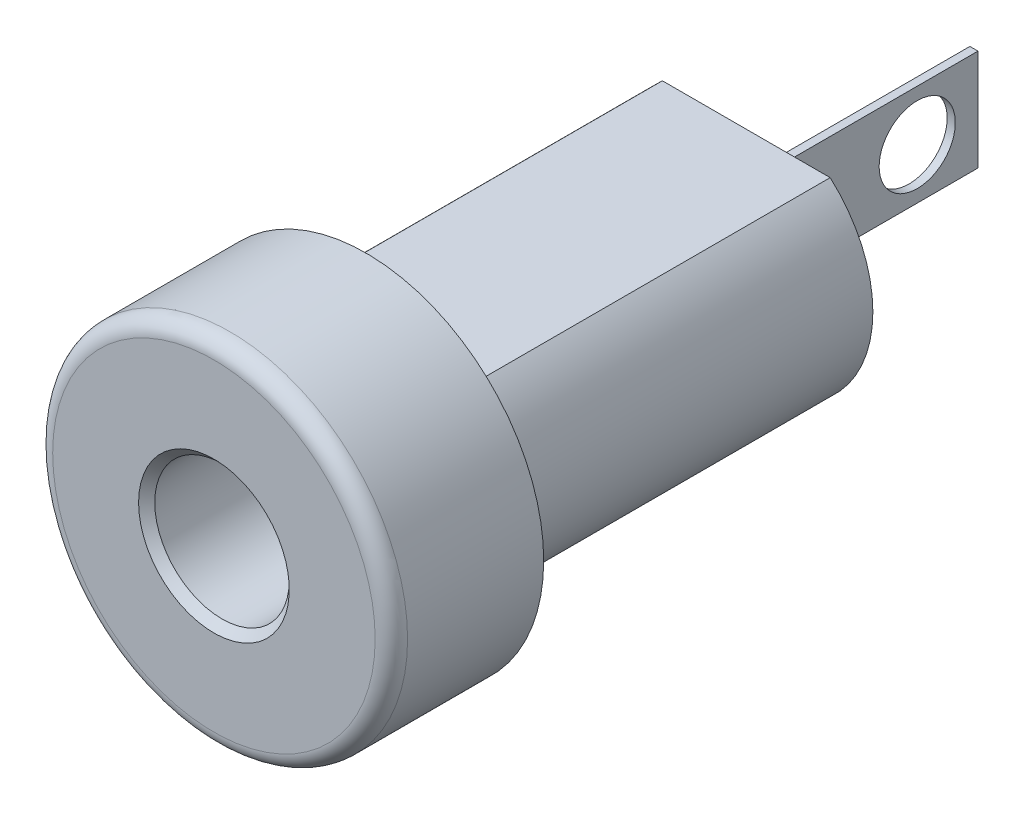
ISO-10303-21;
HEADER;
FILE_DESCRIPTION(('STEP AP214'),'2;1');
FILE_NAME('part.step','',(''),(''),'','','');
FILE_SCHEMA(('AUTOMOTIVE_DESIGN { 1 0 10303 214 1 1 1 1 }'));
ENDSEC;
DATA;
#1=APPLICATION_CONTEXT('core data for automotive mechanical design processes');
#2=APPLICATION_PROTOCOL_DEFINITION('international standard','automotive_design',2000,#1);
#3=PRODUCT_CONTEXT('',#1,'mechanical');
#4=PRODUCT('Part','Part','',(#3));
#5=PRODUCT_RELATED_PRODUCT_CATEGORY('part','',(#4));
#6=PRODUCT_DEFINITION_FORMATION('','',#4);
#7=PRODUCT_DEFINITION_CONTEXT('part definition',#1,'design');
#8=PRODUCT_DEFINITION('design','',#6,#7);
#9=PRODUCT_DEFINITION_SHAPE('','',#8);
#10=(LENGTH_UNIT() NAMED_UNIT(*) SI_UNIT(.MILLI.,.METRE.));
#11=(NAMED_UNIT(*) PLANE_ANGLE_UNIT() SI_UNIT($,.RADIAN.));
#12=(NAMED_UNIT(*) SI_UNIT($,.STERADIAN.) SOLID_ANGLE_UNIT());
#13=UNCERTAINTY_MEASURE_WITH_UNIT(LENGTH_MEASURE(1.E-05),#10,'distance_accuracy_value','');
#14=(GEOMETRIC_REPRESENTATION_CONTEXT(3) GLOBAL_UNCERTAINTY_ASSIGNED_CONTEXT((#13)) GLOBAL_UNIT_ASSIGNED_CONTEXT((#10,
#11,#12)) REPRESENTATION_CONTEXT('',''));
#15=CARTESIAN_POINT('',(0.,0.,0.));
#16=DIRECTION('',(0.,0.,1.));
#17=DIRECTION('',(1.,0.,0.));
#18=AXIS2_PLACEMENT_3D('',#15,#16,#17);
#19=CARTESIAN_POINT('',(0.,3.96875,-16.6878));
#20=DIRECTION('',(0.,0.,1.));
#21=DIRECTION('',(1.,0.,0.));
#22=AXIS2_PLACEMENT_3D('',#19,#20,#21);
#23=PLANE('',#22);
#24=DIRECTION('',(-1.,0.,0.));
#25=VECTOR('',#24,1.);
#26=CARTESIAN_POINT('',(0.,2.9718,-16.6878));
#27=LINE('',#26,#25);
#28=CARTESIAN_POINT('',(2.63047169201647,2.9718,-16.6878));
#29=VERTEX_POINT('',#28);
#30=CARTESIAN_POINT('',(-2.63047169201647,2.9718,-16.6878));
#31=VERTEX_POINT('',#30);
#32=EDGE_CURVE('E170',#29,#31,#27,.T.);
#33=ORIENTED_EDGE('',*,*,#32,.F.);
#34=CARTESIAN_POINT('',(0.,0.,-16.6878));
#35=DIRECTION('',(0.,0.,1.));
#36=DIRECTION('',(1.,0.,0.));
#37=AXIS2_PLACEMENT_3D('',#34,#35,#36);
#38=CIRCLE('',#37,3.96875);
#39=CARTESIAN_POINT('',(2.63047169201647,-2.9718,-16.6878));
#40=VERTEX_POINT('',#39);
#41=EDGE_CURVE('E152',#40,#29,#38,.T.);
#42=ORIENTED_EDGE('',*,*,#41,.F.);
#43=DIRECTION('',(1.,0.,0.));
#44=VECTOR('',#43,1.);
#45=CARTESIAN_POINT('',(0.,-2.9718,-16.6878));
#46=LINE('',#45,#44);
#47=CARTESIAN_POINT('',(-2.63047169201647,-2.9718,-16.6878));
#48=VERTEX_POINT('',#47);
#49=EDGE_CURVE('E168',#48,#40,#46,.T.);
#50=ORIENTED_EDGE('',*,*,#49,.F.);
#51=EDGE_CURVE('E154',#31,#48,#38,.T.);
#52=ORIENTED_EDGE('',*,*,#51,.F.);
#53=EDGE_LOOP('',(#33,#42,#50,#52));
#54=FACE_BOUND('',#53,.T.);
#55=DIRECTION('',(-1.,0.,0.));
#56=VECTOR('',#55,1.);
#57=CARTESIAN_POINT('',(7.0104,-1.2065,-16.6878));
#58=LINE('',#57,#56);
#59=CARTESIAN_POINT('',(0.127,-1.2065,-16.6878));
#60=VERTEX_POINT('',#59);
#61=CARTESIAN_POINT('',(-0.127,-1.2065,-16.6878));
#62=VERTEX_POINT('',#61);
#63=EDGE_CURVE('E49',#60,#62,#58,.T.);
#64=ORIENTED_EDGE('',*,*,#63,.F.);
#65=DIRECTION('',(0.,-1.,0.));
#66=VECTOR('',#65,1.);
#67=CARTESIAN_POINT('',(0.127,-1.5875,-16.6878));
#68=LINE('',#67,#66);
#69=CARTESIAN_POINT('',(0.127,1.2065,-16.6878));
#70=VERTEX_POINT('',#69);
#71=EDGE_CURVE('E418',#70,#60,#68,.T.);
#72=ORIENTED_EDGE('',*,*,#71,.F.);
#73=DIRECTION('',(-1.,0.,0.));
#74=VECTOR('',#73,1.);
#75=CARTESIAN_POINT('',(7.0104,1.2065,-16.6878));
#76=LINE('',#75,#74);
#77=CARTESIAN_POINT('',(-0.127,1.2065,-16.6878));
#78=VERTEX_POINT('',#77);
#79=EDGE_CURVE('E408',#70,#78,#76,.T.);
#80=ORIENTED_EDGE('',*,*,#79,.T.);
#81=DIRECTION('',(0.,1.,0.));
#82=VECTOR('',#81,1.);
#83=CARTESIAN_POINT('',(-0.127,-1.5875,-16.6878));
#84=LINE('',#83,#82);
#85=EDGE_CURVE('E406',#62,#78,#84,.T.);
#86=ORIENTED_EDGE('',*,*,#85,.F.);
#87=EDGE_LOOP('',(#64,#72,#80,#86));
#88=FACE_BOUND('',#87,.T.);
#89=ADVANCED_FACE('F34',(#54,#88),#23,.F.);
#90=CARTESIAN_POINT('',(0.,0.,0.));
#91=DIRECTION('',(0.,0.,1.));
#92=DIRECTION('',(1.,0.,0.));
#93=AXIS2_PLACEMENT_3D('',#90,#91,#92);
#94=CYLINDRICAL_SURFACE('',#93,3.96875);
#95=DIRECTION('',(0.,0.,1.));
#96=VECTOR('',#95,1.);
#97=CARTESIAN_POINT('',(-2.63047169201647,2.9718,0.));
#98=LINE('',#97,#96);
#99=CARTESIAN_POINT('',(-2.63047169201647,2.9718,-4.7752));
#100=VERTEX_POINT('',#99);
#101=EDGE_CURVE('E150',#31,#100,#98,.T.);
#102=ORIENTED_EDGE('',*,*,#101,.F.);
#103=ORIENTED_EDGE('',*,*,#51,.T.);
#104=DIRECTION('',(0.,0.,1.));
#105=VECTOR('',#104,1.);
#106=CARTESIAN_POINT('',(-2.63047169201647,-2.9718,0.));
#107=LINE('',#106,#105);
#108=CARTESIAN_POINT('',(-2.63047169201647,-2.9718,-4.7752));
#109=VERTEX_POINT('',#108);
#110=EDGE_CURVE('E143',#109,#48,#107,.F.);
#111=ORIENTED_EDGE('',*,*,#110,.F.);
#112=CARTESIAN_POINT('',(0.,0.,-4.7752));
#113=DIRECTION('',(0.,0.,1.));
#114=DIRECTION('',(1.,0.,0.));
#115=AXIS2_PLACEMENT_3D('',#112,#113,#114);
#116=CIRCLE('',#115,3.96875);
#117=EDGE_CURVE('E158',#100,#109,#116,.T.);
#118=ORIENTED_EDGE('',*,*,#117,.F.);
#119=EDGE_LOOP('',(#102,#103,#111,#118));
#120=FACE_BOUND('',#119,.T.);
#121=ADVANCED_FACE('F189',(#120),#94,.T.);
#122=DIRECTION('',(0.,0.,1.));
#123=VECTOR('',#122,1.);
#124=CARTESIAN_POINT('',(2.63047169201647,2.9718,0.));
#125=LINE('',#124,#123);
#126=CARTESIAN_POINT('',(2.63047169201647,2.9718,-4.7752));
#127=VERTEX_POINT('',#126);
#128=EDGE_CURVE('E147',#127,#29,#125,.F.);
#129=ORIENTED_EDGE('',*,*,#128,.F.);
#130=CARTESIAN_POINT('',(2.63047169201647,-2.9718,-4.7752));
#131=VERTEX_POINT('',#130);
#132=EDGE_CURVE('E155',#131,#127,#116,.T.);
#133=ORIENTED_EDGE('',*,*,#132,.F.);
#134=DIRECTION('',(0.,0.,1.));
#135=VECTOR('',#134,1.);
#136=CARTESIAN_POINT('',(2.63047169201647,-2.9718,0.));
#137=LINE('',#136,#135);
#138=EDGE_CURVE('E145',#40,#131,#137,.T.);
#139=ORIENTED_EDGE('',*,*,#138,.F.);
#140=ORIENTED_EDGE('',*,*,#41,.T.);
#141=EDGE_LOOP('',(#129,#133,#139,#140));
#142=FACE_BOUND('',#141,.T.);
#143=ADVANCED_FACE('F195',(#142),#94,.T.);
#144=CARTESIAN_POINT('',(0.,0.,0.));
#145=DIRECTION('',(0.,0.,-1.));
#146=DIRECTION('',(-1.,0.,0.));
#147=AXIS2_PLACEMENT_3D('',#144,#145,#146);
#148=PLANE('',#147);
#149=CARTESIAN_POINT('',(0.,0.,0.));
#150=DIRECTION('',(0.,0.,-1.));
#151=DIRECTION('',(-1.,0.,0.));
#152=AXIS2_PLACEMENT_3D('',#149,#150,#151);
#153=CIRCLE('',#152,2.3622);
#154=CARTESIAN_POINT('',(-2.3622,0.,0.));
#155=VERTEX_POINT('',#154);
#156=EDGE_CURVE('E12',#155,#155,#153,.T.);
#157=ORIENTED_EDGE('',*,*,#156,.T.);
#158=EDGE_LOOP('',(#157));
#159=FACE_BOUND('',#158,.T.);
#160=CARTESIAN_POINT('',(0.,0.,0.));
#161=DIRECTION('',(0.,0.,-1.));
#162=DIRECTION('',(-1.,0.,0.));
#163=AXIS2_PLACEMENT_3D('',#160,#161,#162);
#164=CIRCLE('',#163,5.0546);
#165=CARTESIAN_POINT('',(-5.0546,0.,0.));
#166=VERTEX_POINT('',#165);
#167=EDGE_CURVE('E162',#166,#166,#164,.F.);
#168=ORIENTED_EDGE('',*,*,#167,.T.);
#169=EDGE_LOOP('',(#168));
#170=FACE_BOUND('',#169,.T.);
#171=ADVANCED_FACE('F212',(#159,#170),#148,.F.);
#172=CARTESIAN_POINT('',(0.,0.,0.));
#173=DIRECTION('',(0.,0.,1.));
#174=DIRECTION('',(1.,0.,0.));
#175=AXIS2_PLACEMENT_3D('',#172,#173,#174);
#176=CYLINDRICAL_SURFACE('',#175,5.5626);
#177=CARTESIAN_POINT('',(0.,0.,-0.508));
#178=DIRECTION('',(0.,0.,-1.));
#179=DIRECTION('',(-1.,0.,0.));
#180=AXIS2_PLACEMENT_3D('',#177,#178,#179);
#181=CIRCLE('',#180,5.5626);
#182=CARTESIAN_POINT('',(-5.5626,0.,-0.508));
#183=VERTEX_POINT('',#182);
#184=EDGE_CURVE('E165',#183,#183,#181,.T.);
#185=ORIENTED_EDGE('',*,*,#184,.T.);
#186=EDGE_LOOP('',(#185));
#187=FACE_BOUND('',#186,.T.);
#188=CARTESIAN_POINT('',(0.,0.,-4.7752));
#189=DIRECTION('',(0.,0.,1.));
#190=DIRECTION('',(1.,0.,0.));
#191=AXIS2_PLACEMENT_3D('',#188,#189,#190);
#192=CIRCLE('',#191,5.5626);
#193=CARTESIAN_POINT('',(5.5626,0.,-4.7752));
#194=VERTEX_POINT('',#193);
#195=EDGE_CURVE('E159',#194,#194,#192,.T.);
#196=ORIENTED_EDGE('',*,*,#195,.T.);
#197=EDGE_LOOP('',(#196));
#198=FACE_BOUND('',#197,.T.);
#199=ADVANCED_FACE('F208',(#187,#198),#176,.T.);
#200=CARTESIAN_POINT('',(0.,5.5626,-4.7752));
#201=DIRECTION('',(0.,0.,1.));
#202=DIRECTION('',(1.,0.,0.));
#203=AXIS2_PLACEMENT_3D('',#200,#201,#202);
#204=PLANE('',#203);
#205=ORIENTED_EDGE('',*,*,#195,.F.);
#206=EDGE_LOOP('',(#205));
#207=FACE_BOUND('',#206,.T.);
#208=ORIENTED_EDGE('',*,*,#132,.T.);
#209=DIRECTION('',(1.,0.,0.));
#210=VECTOR('',#209,1.);
#211=CARTESIAN_POINT('',(-4.70222537954105,2.9718,-4.7752));
#212=LINE('',#211,#210);
#213=EDGE_CURVE('E133',#100,#127,#212,.T.);
#214=ORIENTED_EDGE('',*,*,#213,.F.);
#215=ORIENTED_EDGE('',*,*,#117,.T.);
#216=DIRECTION('',(-1.,0.,0.));
#217=VECTOR('',#216,1.);
#218=CARTESIAN_POINT('',(-4.70222537954105,-2.9718,-4.7752));
#219=LINE('',#218,#217);
#220=EDGE_CURVE('E141',#131,#109,#219,.T.);
#221=ORIENTED_EDGE('',*,*,#220,.F.);
#222=EDGE_LOOP('',(#208,#214,#215,#221));
#223=FACE_BOUND('',#222,.T.);
#224=ADVANCED_FACE('F204',(#207,#223),#204,.F.);
#225=CARTESIAN_POINT('',(0.,0.,-0.508));
#226=DIRECTION('',(0.,0.,-1.));
#227=DIRECTION('',(-1.,0.,0.));
#228=AXIS2_PLACEMENT_3D('',#225,#226,#227);
#229=TOROIDAL_SURFACE('',#228,5.0546,0.508);
#230=ORIENTED_EDGE('',*,*,#184,.F.);
#231=EDGE_LOOP('',(#230));
#232=FACE_BOUND('',#231,.T.);
#233=ORIENTED_EDGE('',*,*,#167,.F.);
#234=EDGE_LOOP('',(#233));
#235=FACE_BOUND('',#234,.T.);
#236=ADVANCED_FACE('F207',(#232,#235),#229,.T.);
#237=CARTESIAN_POINT('',(-4.70222537954105,-2.9718,11.9476646539437));
#238=DIRECTION('',(0.,-1.,0.));
#239=DIRECTION('',(0.,0.,-1.));
#240=AXIS2_PLACEMENT_3D('',#237,#238,#239);
#241=PLANE('',#240);
#242=ORIENTED_EDGE('',*,*,#138,.T.);
#243=ORIENTED_EDGE('',*,*,#220,.T.);
#244=ORIENTED_EDGE('',*,*,#110,.T.);
#245=ORIENTED_EDGE('',*,*,#49,.T.);
#246=EDGE_LOOP('',(#242,#243,#244,#245));
#247=FACE_BOUND('',#246,.T.);
#248=ADVANCED_FACE('F217',(#247),#241,.T.);
#249=CARTESIAN_POINT('',(-4.70222537954105,2.9718,11.9476646539437));
#250=DIRECTION('',(0.,1.,0.));
#251=DIRECTION('',(0.,0.,1.));
#252=AXIS2_PLACEMENT_3D('',#249,#250,#251);
#253=PLANE('',#252);
#254=ORIENTED_EDGE('',*,*,#101,.T.);
#255=ORIENTED_EDGE('',*,*,#213,.T.);
#256=ORIENTED_EDGE('',*,*,#128,.T.);
#257=ORIENTED_EDGE('',*,*,#32,.T.);
#258=EDGE_LOOP('',(#254,#255,#256,#257));
#259=FACE_BOUND('',#258,.T.);
#260=ADVANCED_FACE('F201',(#259),#253,.T.);
#261=CARTESIAN_POINT('',(0.127,-1.5875,-23.8252));
#262=DIRECTION('',(-1.,0.,0.));
#263=DIRECTION('',(0.,0.,1.));
#264=AXIS2_PLACEMENT_3D('',#261,#262,#263);
#265=PLANE('',#264);
#266=CARTESIAN_POINT('',(0.127,0.,-21.9202));
#267=DIRECTION('',(-1.,0.,0.));
#268=DIRECTION('',(0.,0.,1.));
#269=AXIS2_PLACEMENT_3D('',#266,#267,#268);
#270=CIRCLE('',#269,1.1938);
#271=CARTESIAN_POINT('',(0.127,0.,-20.7264));
#272=VERTEX_POINT('',#271);
#273=EDGE_CURVE('E421',#272,#272,#270,.T.);
#274=ORIENTED_EDGE('',*,*,#273,.T.);
#275=EDGE_LOOP('',(#274));
#276=FACE_BOUND('',#275,.T.);
#277=ORIENTED_EDGE('',*,*,#71,.T.);
#278=DIRECTION('',(0.,-0.514495755427529,-0.857492925712543));
#279=VECTOR('',#278,1.);
#280=CARTESIAN_POINT('',(0.127,-4.45620588235295,-22.1039764705882));
#281=LINE('',#280,#279);
#282=CARTESIAN_POINT('',(0.127,-1.5875,-17.3228));
#283=VERTEX_POINT('',#282);
#284=EDGE_CURVE('E126',#60,#283,#281,.T.);
#285=ORIENTED_EDGE('',*,*,#284,.T.);
#286=DIRECTION('',(0.,0.,1.));
#287=VECTOR('',#286,1.);
#288=CARTESIAN_POINT('',(0.127,-1.5875,-23.8252));
#289=LINE('',#288,#287);
#290=CARTESIAN_POINT('',(0.127,-1.5875,-23.8252));
#291=VERTEX_POINT('',#290);
#292=EDGE_CURVE('E125',#291,#283,#289,.T.);
#293=ORIENTED_EDGE('',*,*,#292,.F.);
#294=DIRECTION('',(0.,-1.,0.));
#295=VECTOR('',#294,1.);
#296=CARTESIAN_POINT('',(0.127,-1.5875,-23.8252));
#297=LINE('',#296,#295);
#298=CARTESIAN_POINT('',(0.127,1.5875,-23.8252));
#299=VERTEX_POINT('',#298);
#300=EDGE_CURVE('E422',#299,#291,#297,.T.);
#301=ORIENTED_EDGE('',*,*,#300,.F.);
#302=DIRECTION('',(0.,0.,1.));
#303=VECTOR('',#302,1.);
#304=CARTESIAN_POINT('',(0.127,1.5875,-23.8252));
#305=LINE('',#304,#303);
#306=CARTESIAN_POINT('',(0.127,1.5875,-17.3228));
#307=VERTEX_POINT('',#306);
#308=EDGE_CURVE('E136',#299,#307,#305,.T.);
#309=ORIENTED_EDGE('',*,*,#308,.T.);
#310=DIRECTION('',(0.,-0.514495755427529,0.857492925712543));
#311=VECTOR('',#310,1.);
#312=CARTESIAN_POINT('',(0.127,3.61576470588236,-20.7032411764706));
#313=LINE('',#312,#311);
#314=EDGE_CURVE('E57',#307,#70,#313,.T.);
#315=ORIENTED_EDGE('',*,*,#314,.T.);
#316=EDGE_LOOP('',(#277,#285,#293,#301,#309,#315));
#317=FACE_BOUND('',#316,.T.);
#318=ADVANCED_FACE('F246',(#276,#317),#265,.F.);
#319=CARTESIAN_POINT('',(-0.127,-1.5875,-23.8252));
#320=DIRECTION('',(0.,1.,0.));
#321=DIRECTION('',(0.,0.,1.));
#322=AXIS2_PLACEMENT_3D('',#319,#320,#321);
#323=PLANE('',#322);
#324=ORIENTED_EDGE('',*,*,#292,.T.);
#325=DIRECTION('',(-1.,0.,0.));
#326=VECTOR('',#325,1.);
#327=CARTESIAN_POINT('',(7.0104,-1.5875,-17.3228));
#328=LINE('',#327,#326);
#329=CARTESIAN_POINT('',(-0.127,-1.5875,-17.3228));
#330=VERTEX_POINT('',#329);
#331=EDGE_CURVE('E111',#283,#330,#328,.T.);
#332=ORIENTED_EDGE('',*,*,#331,.T.);
#333=DIRECTION('',(0.,0.,1.));
#334=VECTOR('',#333,1.);
#335=CARTESIAN_POINT('',(-0.127,-1.5875,-23.8252));
#336=LINE('',#335,#334);
#337=CARTESIAN_POINT('',(-0.127,-1.5875,-23.8252));
#338=VERTEX_POINT('',#337);
#339=EDGE_CURVE('E122',#338,#330,#336,.T.);
#340=ORIENTED_EDGE('',*,*,#339,.F.);
#341=DIRECTION('',(-1.,0.,0.));
#342=VECTOR('',#341,1.);
#343=CARTESIAN_POINT('',(-0.127,-1.5875,-23.8252));
#344=LINE('',#343,#342);
#345=EDGE_CURVE('E414',#291,#338,#344,.T.);
#346=ORIENTED_EDGE('',*,*,#345,.F.);
#347=EDGE_LOOP('',(#324,#332,#340,#346));
#348=FACE_BOUND('',#347,.T.);
#349=ADVANCED_FACE('F121',(#348),#323,.F.);
#350=CARTESIAN_POINT('',(-0.127,-1.5875,-23.8252));
#351=DIRECTION('',(1.,0.,0.));
#352=DIRECTION('',(0.,0.,-1.));
#353=AXIS2_PLACEMENT_3D('',#350,#351,#352);
#354=PLANE('',#353);
#355=CARTESIAN_POINT('',(-0.127,0.,-21.9202));
#356=DIRECTION('',(-1.,0.,0.));
#357=DIRECTION('',(0.,0.,1.));
#358=AXIS2_PLACEMENT_3D('',#355,#356,#357);
#359=CIRCLE('',#358,1.1938);
#360=CARTESIAN_POINT('',(-0.127,0.,-20.7264));
#361=VERTEX_POINT('',#360);
#362=EDGE_CURVE('E426',#361,#361,#359,.T.);
#363=ORIENTED_EDGE('',*,*,#362,.F.);
#364=EDGE_LOOP('',(#363));
#365=FACE_BOUND('',#364,.T.);
#366=ORIENTED_EDGE('',*,*,#339,.T.);
#367=DIRECTION('',(0.,-0.514495755427529,-0.857492925712543));
#368=VECTOR('',#367,1.);
#369=CARTESIAN_POINT('',(-0.127,-1.2065,-16.6878));
#370=LINE('',#369,#368);
#371=EDGE_CURVE('E108',#62,#330,#370,.T.);
#372=ORIENTED_EDGE('',*,*,#371,.F.);
#373=ORIENTED_EDGE('',*,*,#85,.T.);
#374=DIRECTION('',(0.,-0.514495755427529,0.857492925712543));
#375=VECTOR('',#374,1.);
#376=CARTESIAN_POINT('',(-0.127,1.2065,-16.6878));
#377=LINE('',#376,#375);
#378=CARTESIAN_POINT('',(-0.127,1.5875,-17.3228));
#379=VERTEX_POINT('',#378);
#380=EDGE_CURVE('E402',#379,#78,#377,.T.);
#381=ORIENTED_EDGE('',*,*,#380,.F.);
#382=DIRECTION('',(0.,0.,1.));
#383=VECTOR('',#382,1.);
#384=CARTESIAN_POINT('',(-0.127,1.5875,-23.8252));
#385=LINE('',#384,#383);
#386=CARTESIAN_POINT('',(-0.127,1.5875,-23.8252));
#387=VERTEX_POINT('',#386);
#388=EDGE_CURVE('E131',#387,#379,#385,.T.);
#389=ORIENTED_EDGE('',*,*,#388,.F.);
#390=DIRECTION('',(0.,1.,0.));
#391=VECTOR('',#390,1.);
#392=CARTESIAN_POINT('',(-0.127,-1.5875,-23.8252));
#393=LINE('',#392,#391);
#394=EDGE_CURVE('E130',#338,#387,#393,.T.);
#395=ORIENTED_EDGE('',*,*,#394,.F.);
#396=EDGE_LOOP('',(#366,#372,#373,#381,#389,#395));
#397=FACE_BOUND('',#396,.T.);
#398=ADVANCED_FACE('F128',(#365,#397),#354,.F.);
#399=CARTESIAN_POINT('',(-0.127,1.5875,-23.8252));
#400=DIRECTION('',(0.,-1.,0.));
#401=DIRECTION('',(0.,0.,-1.));
#402=AXIS2_PLACEMENT_3D('',#399,#400,#401);
#403=PLANE('',#402);
#404=ORIENTED_EDGE('',*,*,#388,.T.);
#405=DIRECTION('',(1.,0.,0.));
#406=VECTOR('',#405,1.);
#407=CARTESIAN_POINT('',(-0.127,1.5875,-17.3228));
#408=LINE('',#407,#406);
#409=EDGE_CURVE('E172',#379,#307,#408,.T.);
#410=ORIENTED_EDGE('',*,*,#409,.T.);
#411=ORIENTED_EDGE('',*,*,#308,.F.);
#412=DIRECTION('',(1.,0.,0.));
#413=VECTOR('',#412,1.);
#414=CARTESIAN_POINT('',(-0.127,1.5875,-23.8252));
#415=LINE('',#414,#413);
#416=EDGE_CURVE('E410',#387,#299,#415,.T.);
#417=ORIENTED_EDGE('',*,*,#416,.F.);
#418=EDGE_LOOP('',(#404,#410,#411,#417));
#419=FACE_BOUND('',#418,.T.);
#420=ADVANCED_FACE('F261',(#419),#403,.F.);
#421=CARTESIAN_POINT('',(0.127,1.5875,-23.8252));
#422=DIRECTION('',(0.,0.,-1.));
#423=DIRECTION('',(-1.,0.,0.));
#424=AXIS2_PLACEMENT_3D('',#421,#422,#423);
#425=PLANE('',#424);
#426=ORIENTED_EDGE('',*,*,#300,.T.);
#427=ORIENTED_EDGE('',*,*,#345,.T.);
#428=ORIENTED_EDGE('',*,*,#394,.T.);
#429=ORIENTED_EDGE('',*,*,#416,.T.);
#430=EDGE_LOOP('',(#426,#427,#428,#429));
#431=FACE_BOUND('',#430,.T.);
#432=ADVANCED_FACE('F265',(#431),#425,.T.);
#433=CARTESIAN_POINT('',(7.0104,0.,-21.9202));
#434=DIRECTION('',(-1.,0.,0.));
#435=DIRECTION('',(0.,0.,1.));
#436=AXIS2_PLACEMENT_3D('',#433,#434,#435);
#437=CYLINDRICAL_SURFACE('',#436,1.1938);
#438=ORIENTED_EDGE('',*,*,#362,.T.);
#439=EDGE_LOOP('',(#438));
#440=FACE_BOUND('',#439,.T.);
#441=ORIENTED_EDGE('',*,*,#273,.F.);
#442=EDGE_LOOP('',(#441));
#443=FACE_BOUND('',#442,.T.);
#444=ADVANCED_FACE('F269',(#440,#443),#437,.F.);
#445=CARTESIAN_POINT('',(7.0104,1.2065,-16.6878));
#446=DIRECTION('',(0.,-0.857492925712543,-0.514495755427529));
#447=DIRECTION('',(0.,0.514495755427529,-0.857492925712543));
#448=AXIS2_PLACEMENT_3D('',#445,#446,#447);
#449=PLANE('',#448);
#450=ORIENTED_EDGE('',*,*,#409,.F.);
#451=ORIENTED_EDGE('',*,*,#380,.T.);
#452=ORIENTED_EDGE('',*,*,#79,.F.);
#453=ORIENTED_EDGE('',*,*,#314,.F.);
#454=EDGE_LOOP('',(#450,#451,#452,#453));
#455=FACE_BOUND('',#454,.T.);
#456=ADVANCED_FACE('F273',(#455),#449,.F.);
#457=CARTESIAN_POINT('',(7.0104,-1.2065,-16.6878));
#458=DIRECTION('',(0.,0.857492925712543,-0.514495755427529));
#459=DIRECTION('',(0.,0.514495755427529,0.857492925712543));
#460=AXIS2_PLACEMENT_3D('',#457,#458,#459);
#461=PLANE('',#460);
#462=ORIENTED_EDGE('',*,*,#63,.T.);
#463=ORIENTED_EDGE('',*,*,#371,.T.);
#464=ORIENTED_EDGE('',*,*,#331,.F.);
#465=ORIENTED_EDGE('',*,*,#284,.F.);
#466=EDGE_LOOP('',(#462,#463,#464,#465));
#467=FACE_BOUND('',#466,.T.);
#468=ADVANCED_FACE('F110',(#467),#461,.F.);
#469=CARTESIAN_POINT('',(0.,0.,-15.875));
#470=DIRECTION('',(0.,0.,1.));
#471=DIRECTION('',(1.,0.,0.));
#472=AXIS2_PLACEMENT_3D('',#469,#470,#471);
#473=CYLINDRICAL_SURFACE('',#472,2.1082);
#474=CARTESIAN_POINT('',(0.,0.,-0.254000000000003));
#475=DIRECTION('',(0.,0.,-1.));
#476=DIRECTION('',(-1.,0.,0.));
#477=AXIS2_PLACEMENT_3D('',#474,#475,#476);
#478=CIRCLE('',#477,2.1082);
#479=CARTESIAN_POINT('',(-2.1082,0.,-0.254000000000003));
#480=VERTEX_POINT('',#479);
#481=EDGE_CURVE('E42',#480,#480,#478,.F.);
#482=ORIENTED_EDGE('',*,*,#481,.T.);
#483=EDGE_LOOP('',(#482));
#484=FACE_BOUND('',#483,.T.);
#485=CARTESIAN_POINT('',(0.,0.,-15.875));
#486=DIRECTION('',(0.,0.,1.));
#487=DIRECTION('',(1.,0.,0.));
#488=AXIS2_PLACEMENT_3D('',#485,#486,#487);
#489=CIRCLE('',#488,2.1082);
#490=CARTESIAN_POINT('',(2.1082,0.,-15.875));
#491=VERTEX_POINT('',#490);
#492=EDGE_CURVE('E116',#491,#491,#489,.T.);
#493=ORIENTED_EDGE('',*,*,#492,.F.);
#494=EDGE_LOOP('',(#493));
#495=FACE_BOUND('',#494,.T.);
#496=ADVANCED_FACE('F176',(#484,#495),#473,.F.);
#497=CARTESIAN_POINT('',(0.,0.,-15.875));
#498=DIRECTION('',(0.,0.,1.));
#499=DIRECTION('',(1.,0.,0.));
#500=AXIS2_PLACEMENT_3D('',#497,#498,#499);
#501=PLANE('',#500);
#502=ORIENTED_EDGE('',*,*,#492,.T.);
#503=EDGE_LOOP('',(#502));
#504=FACE_BOUND('',#503,.T.);
#505=ADVANCED_FACE('F180',(#504),#501,.T.);
#506=CARTESIAN_POINT('',(0.,0.,-0.254000000000003));
#507=DIRECTION('',(0.,0.,1.));
#508=DIRECTION('',(1.,0.,0.));
#509=AXIS2_PLACEMENT_3D('',#506,#507,#508);
#510=CONICAL_SURFACE('',#509,2.1082,0.785398163397447);
#511=ORIENTED_EDGE('',*,*,#156,.F.);
#512=EDGE_LOOP('',(#511));
#513=FACE_BOUND('',#512,.T.);
#514=ORIENTED_EDGE('',*,*,#481,.F.);
#515=EDGE_LOOP('',(#514));
#516=FACE_BOUND('',#515,.T.);
#517=ADVANCED_FACE('F36',(#513,#516),#510,.F.);
#518=CLOSED_SHELL('',(#89,#121,#143,#171,#199,#224,#236,#248,#260,#318,#349,#398,#420,#432,#444,
#456,#468,#496,#505,#517));
#519=MANIFOLD_SOLID_BREP('B2',#518);
#520=ADVANCED_BREP_SHAPE_REPRESENTATION('',(#18,#519),#14);
#521=SHAPE_DEFINITION_REPRESENTATION(#9,#520);
ENDSEC;
END-ISO-10303-21;
